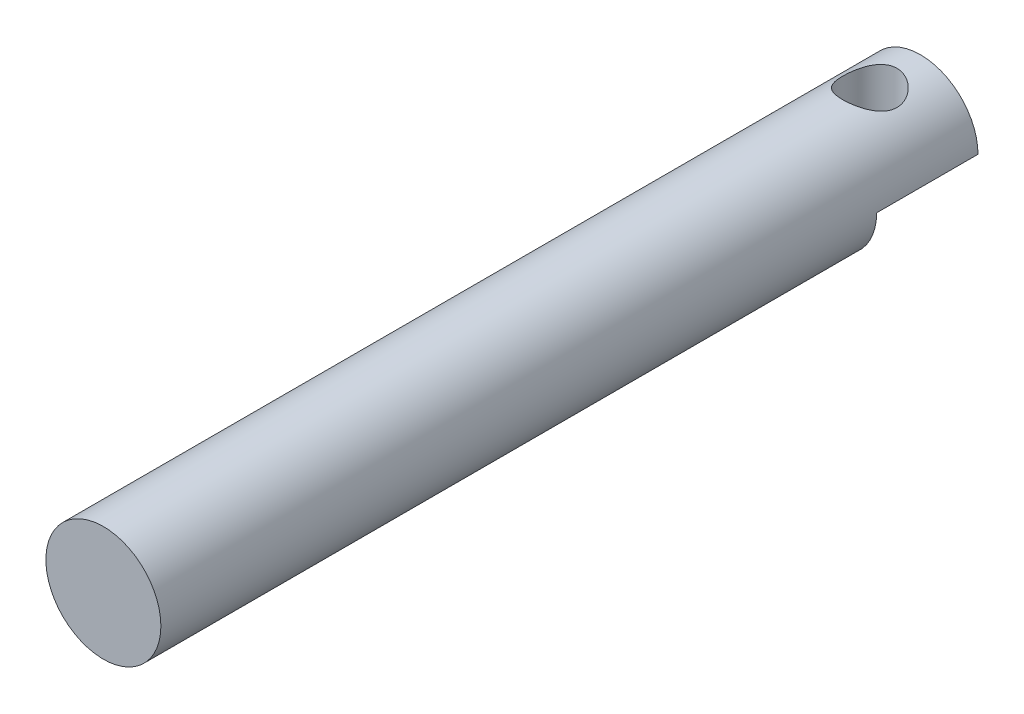
ISO-10303-21;
HEADER;
FILE_DESCRIPTION(('STEP AP214'),'2;1');
FILE_NAME('part.step','',(''),(''),'','','');
FILE_SCHEMA(('AUTOMOTIVE_DESIGN { 1 0 10303 214 1 1 1 1 }'));
ENDSEC;
DATA;
#1=APPLICATION_CONTEXT('core data for automotive mechanical design processes');
#2=APPLICATION_PROTOCOL_DEFINITION('international standard','automotive_design',2000,#1);
#3=PRODUCT_CONTEXT('',#1,'mechanical');
#4=PRODUCT('Part','Part','',(#3));
#5=PRODUCT_RELATED_PRODUCT_CATEGORY('part','',(#4));
#6=PRODUCT_DEFINITION_FORMATION('','',#4);
#7=PRODUCT_DEFINITION_CONTEXT('part definition',#1,'design');
#8=PRODUCT_DEFINITION('design','',#6,#7);
#9=PRODUCT_DEFINITION_SHAPE('','',#8);
#10=(LENGTH_UNIT() NAMED_UNIT(*) SI_UNIT(.MILLI.,.METRE.));
#11=(NAMED_UNIT(*) PLANE_ANGLE_UNIT() SI_UNIT($,.RADIAN.));
#12=(NAMED_UNIT(*) SI_UNIT($,.STERADIAN.) SOLID_ANGLE_UNIT());
#13=UNCERTAINTY_MEASURE_WITH_UNIT(LENGTH_MEASURE(1.E-05),#10,'distance_accuracy_value','');
#14=(GEOMETRIC_REPRESENTATION_CONTEXT(3) GLOBAL_UNCERTAINTY_ASSIGNED_CONTEXT((#13)) GLOBAL_UNIT_ASSIGNED_CONTEXT((#10,
#11,#12)) REPRESENTATION_CONTEXT('',''));
#15=CARTESIAN_POINT('',(0.,0.,0.));
#16=DIRECTION('',(0.,0.,1.));
#17=DIRECTION('',(1.,0.,0.));
#18=AXIS2_PLACEMENT_3D('',#15,#16,#17);
#19=CARTESIAN_POINT('',(0.,0.,45.12));
#20=DIRECTION('',(0.,0.,-1.));
#21=DIRECTION('',(-1.,0.,0.));
#22=AXIS2_PLACEMENT_3D('',#19,#20,#21);
#23=CYLINDRICAL_SURFACE('',#22,3.175);
#24=CARTESIAN_POINT('',(0.,3.175,1.298639110121));
#25=CARTESIAN_POINT('',(0.0793696056331878,3.17499621985294,1.29864358401749));
#26=CARTESIAN_POINT('',(0.158848966213319,3.17199120370814,1.30497575663682));
#27=CARTESIAN_POINT('',(0.3154907966577,3.16026762742416,1.3300394972635));
#28=CARTESIAN_POINT('',(0.392647876041672,3.15153670753249,1.34879788899524));
#29=CARTESIAN_POINT('',(0.542134614016449,3.1292818514019,1.39783447626072));
#30=CARTESIAN_POINT('',(0.614481134826973,3.11577583396693,1.42806963543296));
#31=CARTESIAN_POINT('',(0.75298275747988,3.08523557557938,1.49899464180355));
#32=CARTESIAN_POINT('',(0.819138798737004,3.06820187122341,1.53968289920678));
#33=CARTESIAN_POINT('',(0.947531977551392,3.03109215002452,1.63295248257413));
#34=CARTESIAN_POINT('',(1.00934531536298,3.01089949607389,1.68607019246839));
#35=CARTESIAN_POINT('',(1.12356872804671,2.97016877751052,1.80154509470294));
#36=CARTESIAN_POINT('',(1.17597245123061,2.94963048974006,1.86390847660953));
#37=CARTESIAN_POINT('',(1.27340721108708,2.90895734211161,2.00115474557129));
#38=CARTESIAN_POINT('',(1.31770529611402,2.88894252906622,2.07659756697617));
#39=CARTESIAN_POINT('',(1.39279860497067,2.85350194913633,2.23492460407023));
#40=CARTESIAN_POINT('',(1.4236026358555,2.83807319122874,2.31780392355008));
#41=CARTESIAN_POINT('',(1.46896762087975,2.81484981523147,2.48382178014453));
#42=CARTESIAN_POINT('',(1.48434942407678,2.80667245171199,2.56668000553453));
#43=CARTESIAN_POINT('',(1.50096994970779,2.79782290647243,2.73417241045147));
#44=CARTESIAN_POINT('',(1.5022201551264,2.79714463118969,2.81880509206106));
#45=CARTESIAN_POINT('',(1.49114871052963,2.80305593263808,2.97801441871873));
#46=CARTESIAN_POINT('',(1.48022366031689,2.80889771224103,3.05272226956534));
#47=CARTESIAN_POINT('',(1.44750469243097,2.82589657910714,3.19908379098575));
#48=CARTESIAN_POINT('',(1.42570787921159,2.83705508237193,3.27073664238039));
#49=CARTESIAN_POINT('',(1.37144042107045,2.86368711079333,3.41096056737315));
#50=CARTESIAN_POINT('',(1.33873421633754,2.87925460442575,3.4794218033916));
#51=CARTESIAN_POINT('',(1.26375034917989,2.91294481240157,3.61019488081281));
#52=CARTESIAN_POINT('',(1.22146847336964,2.93106865023239,3.67250399784236));
#53=CARTESIAN_POINT('',(1.12301829304094,2.97027967308475,3.79652512801958));
#54=CARTESIAN_POINT('',(1.06582685913966,2.99147184174414,3.85739445185649));
#55=CARTESIAN_POINT('',(0.941911654521739,3.03276969244737,3.96900603113314));
#56=CARTESIAN_POINT('',(0.875184240523148,3.05287495516681,4.01974439813375));
#57=CARTESIAN_POINT('',(0.730900451942526,3.09065813188422,4.11140464061559));
#58=CARTESIAN_POINT('',(0.653032764749391,3.10821737934191,4.1518892352116));
#59=CARTESIAN_POINT('',(0.490549806409965,3.13795896561378,4.21887396286228));
#60=CARTESIAN_POINT('',(0.405939389394617,3.15014513198241,4.24538405340045));
#61=CARTESIAN_POINT('',(0.239325331183663,3.16698849385516,4.28168583182046));
#62=CARTESIAN_POINT('',(0.15761808537237,3.17215069636453,4.29260213237233));
#63=CARTESIAN_POINT('',(-0.00662006237334085,3.17605374308904,4.30087361184628));
#64=CARTESIAN_POINT('',(-0.0891506200914322,3.17479716715133,4.29823423908701));
#65=CARTESIAN_POINT('',(-0.246790904756254,3.16631250425399,4.28018015989507));
#66=CARTESIAN_POINT('',(-0.322025617263288,3.15949303898597,4.26563942799986));
#67=CARTESIAN_POINT('',(-0.468859911387632,3.14106249856194,4.22551164382716));
#68=CARTESIAN_POINT('',(-0.540459070755478,3.12945086824544,4.19992331169662));
#69=CARTESIAN_POINT('',(-0.680482664613305,3.10206629000487,4.13766633414046));
#70=CARTESIAN_POINT('',(-0.748744433690325,3.0861775760538,4.10068451426519));
#71=CARTESIAN_POINT('',(-0.878333413113474,3.05182842645659,4.01703368457217));
#72=CARTESIAN_POINT('',(-0.939657562453442,3.0333668635778,3.97036042426448));
#73=CARTESIAN_POINT('',(-1.05944471500475,2.99374847615918,3.86379894581481));
#74=CARTESIAN_POINT('',(-1.11715821701519,2.97249840501299,3.80310108003845));
#75=CARTESIAN_POINT('',(-1.22187582163969,2.9310107026401,3.67271906674771));
#76=CARTESIAN_POINT('',(-1.26887443843489,2.91077359415055,3.60303034454683));
#77=CARTESIAN_POINT('',(-1.3523177360002,2.8729842223829,3.45348050442125));
#78=CARTESIAN_POINT('',(-1.3883357483136,2.85555063245793,3.37334883327041));
#79=CARTESIAN_POINT('',(-1.44599796651068,2.82679504093384,3.20706337404008));
#80=CARTESIAN_POINT('',(-1.46765854978947,2.81546607860886,3.12091657183973));
#81=CARTESIAN_POINT('',(-1.49416555358527,2.80148148307169,2.95350251302799));
#82=CARTESIAN_POINT('',(-1.50036748851185,2.79812792823293,2.87250863838967));
#83=CARTESIAN_POINT('',(-1.4995991124721,2.79854075870541,2.7106134382931));
#84=CARTESIAN_POINT('',(-1.4926327833113,2.80230499174775,2.62971209225755));
#85=CARTESIAN_POINT('',(-1.46695547456854,2.81582109373829,2.47677725195426));
#86=CARTESIAN_POINT('',(-1.44918362899975,2.82509293077013,2.40453879441201));
#87=CARTESIAN_POINT('',(-1.40347262111118,2.84807658169596,2.26411015601363));
#88=CARTESIAN_POINT('',(-1.37553039996267,2.86178973121637,2.1959212002645));
#89=CARTESIAN_POINT('',(-1.30816165903836,2.89323433363553,2.06052855829181));
#90=CARTESIAN_POINT('',(-1.26809407534009,2.9111726221189,1.9936931405607));
#91=CARTESIAN_POINT('',(-1.17838069734069,2.94862781691945,1.86727831193667));
#92=CARTESIAN_POINT('',(-1.12873032344155,2.96814547541437,1.80770239264137));
#93=CARTESIAN_POINT('',(-1.01518945377103,3.00898948839188,1.6910830316524));
#94=CARTESIAN_POINT('',(-0.950355540908533,3.03029315236505,1.63494529670393));
#95=CARTESIAN_POINT('',(-0.811506446201233,3.07039060771353,1.53419735584606));
#96=CARTESIAN_POINT('',(-0.737486850130157,3.08918318329392,1.48959272422289));
#97=CARTESIAN_POINT('',(-0.582310323359669,3.12214803509559,1.4135927903461));
#98=CARTESIAN_POINT('',(-0.501179295246575,3.13633626105316,1.38215177628181));
#99=CARTESIAN_POINT('',(-0.334041202489532,3.15849550789229,1.33373668609546));
#100=CARTESIAN_POINT('',(-0.2480493570789,3.16648489362115,1.31671986252476));
#101=CARTESIAN_POINT('',(-0.134449327489636,3.17226666174443,1.30443267672258));
#102=CARTESIAN_POINT('',(-0.10761975081623,3.17328951708221,1.30226255812423));
#103=CARTESIAN_POINT('',(-0.0538643319459688,3.17465683516496,1.29936499974011));
#104=CARTESIAN_POINT('',(-0.0269384876468133,3.17500128300303,1.29863759165553));
#105=CARTESIAN_POINT('',(0.,3.175,1.298639110121));
#106=B_SPLINE_CURVE_WITH_KNOTS('',3,(#24,#25,#26,#27,#28,#29,#30,#31,#32,#33,#34,#35,#36,#37,
#38,#39,#40,#41,#42,#43,#44,#45,#46,#47,#48,#49,#50,#51,#52,#53,#54,#55,#56,#57,#58,#59,#60,#61,
#62,#63,#64,#65,#66,#67,#68,#69,#70,#71,#72,#73,#74,#75,#76,#77,#78,#79,#80,#81,#82,#83,#84,#85,
#86,#87,#88,#89,#90,#91,#92,#93,#94,#95,#96,#97,#98,#99,#100,#101,#102,#103,#104,#105),
.UNSPECIFIED.,.T.,.F.,(4,2,2,2,2,2,2,2,2,2,2,2,2,2,2,2,2,2,2,2,2,2,2,2,2,2,2,2,2,2,2,2,2,2,2,2,
2,2,2,2,4),(0.,0.237998863435127,0.476513162034361,0.714141760487185,0.951734239756923,
1.202566267352,1.45356698050229,1.72144991719773,1.98915775546694,2.24170968929962,
2.4940563909499,2.72018464462581,2.94637315667183,3.17780125644152,3.40933138528568,
3.66670059385932,3.92416839616743,4.19124985366182,4.45814074508092,4.70459764976704,
4.9509555058397,5.18069145066332,5.41045401730286,5.6472008989094,5.88405183355053,
6.14213867221335,6.40035735120202,6.66760822573517,6.93455372246492,7.17710763594645,
7.41958821796886,7.64352093670395,7.86752106087491,8.10644389425159,8.34548119240928,
8.60934561245708,8.8733373285024,9.13640455025375,9.39868939422998,9.47946576344205,
9.56024390756227),.UNSPECIFIED.);
#107=CARTESIAN_POINT('',(0.,3.175,1.298639110121));
#108=VERTEX_POINT('',#107);
#109=EDGE_CURVE('E80',#108,#108,#106,.T.);
#110=ORIENTED_EDGE('',*,*,#109,.T.);
#111=EDGE_LOOP('',(#110));
#112=FACE_BOUND('',#111,.T.);
#113=CARTESIAN_POINT('',(0.,0.,45.12));
#114=DIRECTION('',(0.,0.,1.));
#115=DIRECTION('',(1.,0.,0.));
#116=AXIS2_PLACEMENT_3D('',#113,#114,#115);
#117=CIRCLE('',#116,3.175);
#118=CARTESIAN_POINT('',(3.175,0.,45.12));
#119=VERTEX_POINT('',#118);
#120=EDGE_CURVE('E50',#119,#119,#117,.T.);
#121=ORIENTED_EDGE('',*,*,#120,.F.);
#122=EDGE_LOOP('',(#121));
#123=FACE_BOUND('',#122,.T.);
#124=CARTESIAN_POINT('',(0.,0.,5.597278220242));
#125=DIRECTION('',(0.,0.,1.));
#126=DIRECTION('',(1.,0.,0.));
#127=AXIS2_PLACEMENT_3D('',#124,#125,#126);
#128=CIRCLE('',#127,3.175);
#129=CARTESIAN_POINT('',(-3.175,0.,5.597278220242));
#130=VERTEX_POINT('',#129);
#131=CARTESIAN_POINT('',(3.175,0.,5.597278220242));
#132=VERTEX_POINT('',#131);
#133=EDGE_CURVE('E11',#130,#132,#128,.T.);
#134=ORIENTED_EDGE('',*,*,#133,.T.);
#135=DIRECTION('',(0.,0.,-1.));
#136=VECTOR('',#135,1.);
#137=CARTESIAN_POINT('',(3.175,0.,0.));
#138=LINE('',#137,#136);
#139=CARTESIAN_POINT('',(3.175,0.,0.));
#140=VERTEX_POINT('',#139);
#141=EDGE_CURVE('E73',#132,#140,#138,.T.);
#142=ORIENTED_EDGE('',*,*,#141,.T.);
#143=CARTESIAN_POINT('',(0.,0.,0.));
#144=DIRECTION('',(0.,0.,1.));
#145=DIRECTION('',(1.,0.,0.));
#146=AXIS2_PLACEMENT_3D('',#143,#144,#145);
#147=CIRCLE('',#146,3.175);
#148=CARTESIAN_POINT('',(-3.175,0.,0.));
#149=VERTEX_POINT('',#148);
#150=EDGE_CURVE('E78',#140,#149,#147,.T.);
#151=ORIENTED_EDGE('',*,*,#150,.T.);
#152=DIRECTION('',(0.,0.,1.));
#153=VECTOR('',#152,1.);
#154=CARTESIAN_POINT('',(-3.175,0.,0.));
#155=LINE('',#154,#153);
#156=EDGE_CURVE('E57',#149,#130,#155,.T.);
#157=ORIENTED_EDGE('',*,*,#156,.T.);
#158=EDGE_LOOP('',(#134,#142,#151,#157));
#159=FACE_BOUND('',#158,.T.);
#160=ADVANCED_FACE('F41',(#112,#123,#159),#23,.T.);
#161=CARTESIAN_POINT('',(0.,0.,45.12));
#162=DIRECTION('',(0.,0.,1.));
#163=DIRECTION('',(1.,0.,0.));
#164=AXIS2_PLACEMENT_3D('',#161,#162,#163);
#165=PLANE('',#164);
#166=ORIENTED_EDGE('',*,*,#120,.T.);
#167=EDGE_LOOP('',(#166));
#168=FACE_BOUND('',#167,.T.);
#169=ADVANCED_FACE('F101',(#168),#165,.T.);
#170=CARTESIAN_POINT('',(0.,0.,0.));
#171=DIRECTION('',(0.,0.,1.));
#172=DIRECTION('',(1.,0.,0.));
#173=AXIS2_PLACEMENT_3D('',#170,#171,#172);
#174=PLANE('',#173);
#175=ORIENTED_EDGE('',*,*,#150,.F.);
#176=DIRECTION('',(-1.,0.,0.));
#177=VECTOR('',#176,1.);
#178=CARTESIAN_POINT('',(-3.175,0.,0.));
#179=LINE('',#178,#177);
#180=EDGE_CURVE('E61',#140,#149,#179,.T.);
#181=ORIENTED_EDGE('',*,*,#180,.T.);
#182=EDGE_LOOP('',(#175,#181));
#183=FACE_BOUND('',#182,.T.);
#184=ADVANCED_FACE('F108',(#183),#174,.F.);
#185=CARTESIAN_POINT('',(-3.175,-7.,5.597278220242));
#186=DIRECTION('',(0.,0.,1.));
#187=DIRECTION('',(1.,0.,0.));
#188=AXIS2_PLACEMENT_3D('',#185,#186,#187);
#189=PLANE('',#188);
#190=DIRECTION('',(1.,0.,0.));
#191=VECTOR('',#190,1.);
#192=CARTESIAN_POINT('',(-3.175,0.,5.597278220242));
#193=LINE('',#192,#191);
#194=EDGE_CURVE('E70',#130,#132,#193,.T.);
#195=ORIENTED_EDGE('',*,*,#194,.T.);
#196=ORIENTED_EDGE('',*,*,#133,.F.);
#197=EDGE_LOOP('',(#195,#196));
#198=FACE_BOUND('',#197,.T.);
#199=ADVANCED_FACE('F69',(#198),#189,.F.);
#200=CARTESIAN_POINT('',(0.,0.,0.));
#201=DIRECTION('',(0.,1.,0.));
#202=DIRECTION('',(0.,0.,1.));
#203=AXIS2_PLACEMENT_3D('',#200,#201,#202);
#204=PLANE('',#203);
#205=CARTESIAN_POINT('',(0.,0.,2.798639110121));
#206=DIRECTION('',(0.,-1.,0.));
#207=DIRECTION('',(0.,0.,-1.));
#208=AXIS2_PLACEMENT_3D('',#205,#206,#207);
#209=CIRCLE('',#208,1.5);
#210=CARTESIAN_POINT('',(0.,0.,1.298639110121));
#211=VERTEX_POINT('',#210);
#212=EDGE_CURVE('E84',#211,#211,#209,.T.);
#213=ORIENTED_EDGE('',*,*,#212,.F.);
#214=EDGE_LOOP('',(#213));
#215=FACE_BOUND('',#214,.T.);
#216=ORIENTED_EDGE('',*,*,#156,.F.);
#217=ORIENTED_EDGE('',*,*,#180,.F.);
#218=ORIENTED_EDGE('',*,*,#141,.F.);
#219=ORIENTED_EDGE('',*,*,#194,.F.);
#220=EDGE_LOOP('',(#216,#217,#218,#219));
#221=FACE_BOUND('',#220,.T.);
#222=ADVANCED_FACE('F72',(#215,#221),#204,.F.);
#223=CARTESIAN_POINT('',(0.,7.,2.798639110121));
#224=DIRECTION('',(0.,-1.,0.));
#225=DIRECTION('',(0.,0.,-1.));
#226=AXIS2_PLACEMENT_3D('',#223,#224,#225);
#227=CYLINDRICAL_SURFACE('',#226,1.5);
#228=ORIENTED_EDGE('',*,*,#212,.T.);
#229=EDGE_LOOP('',(#228));
#230=FACE_BOUND('',#229,.T.);
#231=ORIENTED_EDGE('',*,*,#109,.F.);
#232=EDGE_LOOP('',(#231));
#233=FACE_BOUND('',#232,.T.);
#234=ADVANCED_FACE('F112',(#230,#233),#227,.F.);
#235=CLOSED_SHELL('',(#160,#169,#184,#199,#222,#234));
#236=MANIFOLD_SOLID_BREP('B2',#235);
#237=ADVANCED_BREP_SHAPE_REPRESENTATION('',(#18,#236),#14);
#238=SHAPE_DEFINITION_REPRESENTATION(#9,#237);
ENDSEC;
END-ISO-10303-21;
